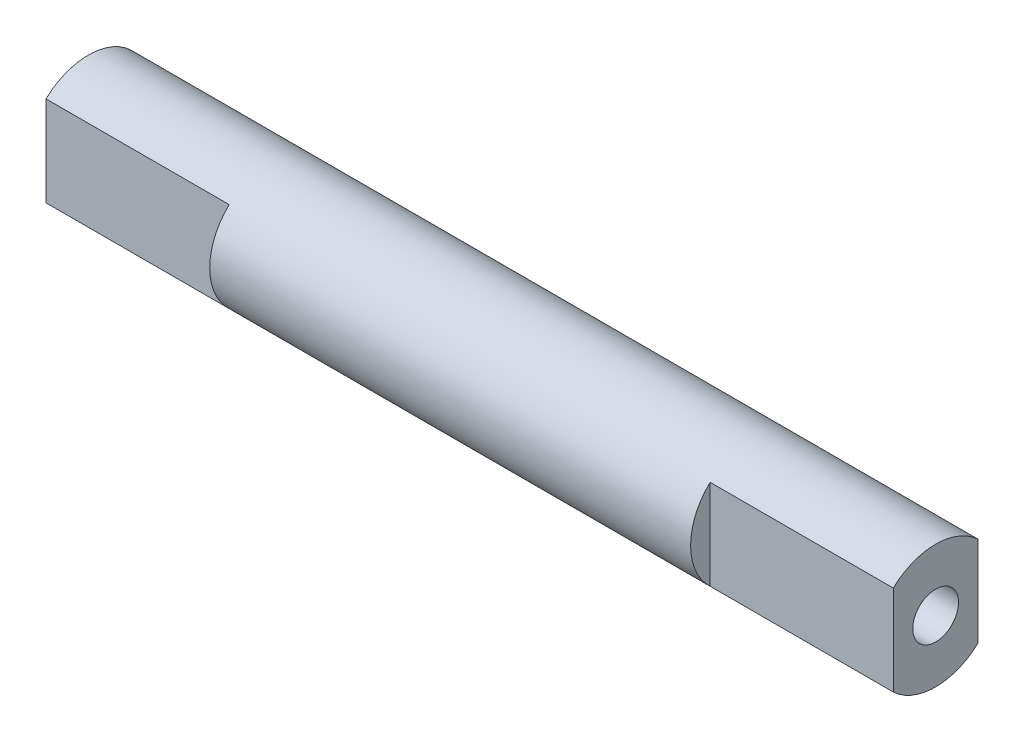
ISO-10303-21;
HEADER;
FILE_DESCRIPTION(('STEP AP214'),'2;1');
FILE_NAME('part.step','',(''),(''),'','','');
FILE_SCHEMA(('AUTOMOTIVE_DESIGN { 1 0 10303 214 1 1 1 1 }'));
ENDSEC;
DATA;
#1=APPLICATION_CONTEXT('core data for automotive mechanical design processes');
#2=APPLICATION_PROTOCOL_DEFINITION('international standard','automotive_design',2000,#1);
#3=PRODUCT_CONTEXT('',#1,'mechanical');
#4=PRODUCT('Part','Part','',(#3));
#5=PRODUCT_RELATED_PRODUCT_CATEGORY('part','',(#4));
#6=PRODUCT_DEFINITION_FORMATION('','',#4);
#7=PRODUCT_DEFINITION_CONTEXT('part definition',#1,'design');
#8=PRODUCT_DEFINITION('design','',#6,#7);
#9=PRODUCT_DEFINITION_SHAPE('','',#8);
#10=(LENGTH_UNIT() NAMED_UNIT(*) SI_UNIT(.MILLI.,.METRE.));
#11=(NAMED_UNIT(*) PLANE_ANGLE_UNIT() SI_UNIT($,.RADIAN.));
#12=(NAMED_UNIT(*) SI_UNIT($,.STERADIAN.) SOLID_ANGLE_UNIT());
#13=UNCERTAINTY_MEASURE_WITH_UNIT(LENGTH_MEASURE(1.E-05),#10,'distance_accuracy_value','');
#14=(GEOMETRIC_REPRESENTATION_CONTEXT(3) GLOBAL_UNCERTAINTY_ASSIGNED_CONTEXT((#13)) GLOBAL_UNIT_ASSIGNED_CONTEXT((#10,
#11,#12)) REPRESENTATION_CONTEXT('',''));
#15=CARTESIAN_POINT('',(0.,0.,0.));
#16=DIRECTION('',(0.,0.,1.));
#17=DIRECTION('',(1.,0.,0.));
#18=AXIS2_PLACEMENT_3D('',#15,#16,#17);
#19=CARTESIAN_POINT('',(18.5,0.,0.));
#20=DIRECTION('',(-1.,0.,0.));
#21=DIRECTION('',(0.,0.,1.));
#22=AXIS2_PLACEMENT_3D('',#19,#20,#21);
#23=CYLINDRICAL_SURFACE('',#22,2.7);
#24=CARTESIAN_POINT('',(18.5,0.,0.));
#25=DIRECTION('',(1.,0.,0.));
#26=DIRECTION('',(0.,0.,-1.));
#27=AXIS2_PLACEMENT_3D('',#24,#25,#26);
#28=CIRCLE('',#27,2.7);
#29=CARTESIAN_POINT('',(18.5,-1.96659604392971,1.85));
#30=VERTEX_POINT('',#29);
#31=CARTESIAN_POINT('',(18.5,-1.96659604392971,-1.85));
#32=VERTEX_POINT('',#31);
#33=EDGE_CURVE('E42',#30,#32,#28,.T.);
#34=ORIENTED_EDGE('',*,*,#33,.F.);
#35=DIRECTION('',(1.,0.,0.));
#36=VECTOR('',#35,1.);
#37=CARTESIAN_POINT('',(10.5,-1.96659604392971,1.85));
#38=LINE('',#37,#36);
#39=CARTESIAN_POINT('',(10.5,-1.96659604392971,1.85));
#40=VERTEX_POINT('',#39);
#41=EDGE_CURVE('E141',#40,#30,#38,.T.);
#42=ORIENTED_EDGE('',*,*,#41,.F.);
#43=CARTESIAN_POINT('',(10.5,0.,0.));
#44=DIRECTION('',(1.,0.,0.));
#45=DIRECTION('',(0.,0.,-1.));
#46=AXIS2_PLACEMENT_3D('',#43,#44,#45);
#47=CIRCLE('',#46,2.7);
#48=CARTESIAN_POINT('',(10.5,1.96659604392971,1.85));
#49=VERTEX_POINT('',#48);
#50=EDGE_CURVE('E135',#49,#40,#47,.T.);
#51=ORIENTED_EDGE('',*,*,#50,.F.);
#52=DIRECTION('',(1.,0.,0.));
#53=VECTOR('',#52,1.);
#54=CARTESIAN_POINT('',(10.5,1.96659604392971,1.85));
#55=LINE('',#54,#53);
#56=CARTESIAN_POINT('',(18.5,1.96659604392971,1.85));
#57=VERTEX_POINT('',#56);
#58=EDGE_CURVE('E144',#49,#57,#55,.T.);
#59=ORIENTED_EDGE('',*,*,#58,.T.);
#60=CARTESIAN_POINT('',(18.5,1.96659604392971,-1.85));
#61=VERTEX_POINT('',#60);
#62=EDGE_CURVE('E11',#61,#57,#28,.T.);
#63=ORIENTED_EDGE('',*,*,#62,.F.);
#64=DIRECTION('',(1.,0.,0.));
#65=VECTOR('',#64,1.);
#66=CARTESIAN_POINT('',(10.5,1.96659604392971,-1.85));
#67=LINE('',#66,#65);
#68=CARTESIAN_POINT('',(10.5,1.96659604392971,-1.85));
#69=VERTEX_POINT('',#68);
#70=EDGE_CURVE('E154',#69,#61,#67,.T.);
#71=ORIENTED_EDGE('',*,*,#70,.F.);
#72=CARTESIAN_POINT('',(10.5,0.,0.));
#73=DIRECTION('',(1.,0.,0.));
#74=DIRECTION('',(0.,0.,-1.));
#75=AXIS2_PLACEMENT_3D('',#72,#73,#74);
#76=CIRCLE('',#75,2.7);
#77=CARTESIAN_POINT('',(10.5,-1.96659604392971,-1.85));
#78=VERTEX_POINT('',#77);
#79=EDGE_CURVE('E149',#78,#69,#76,.T.);
#80=ORIENTED_EDGE('',*,*,#79,.F.);
#81=DIRECTION('',(1.,0.,0.));
#82=VECTOR('',#81,1.);
#83=CARTESIAN_POINT('',(10.5,-1.96659604392971,-1.85));
#84=LINE('',#83,#82);
#85=EDGE_CURVE('E143',#78,#32,#84,.T.);
#86=ORIENTED_EDGE('',*,*,#85,.T.);
#87=EDGE_LOOP('',(#34,#42,#51,#59,#63,#71,#80,#86));
#88=FACE_BOUND('',#87,.T.);
#89=DIRECTION('',(-1.,0.,0.));
#90=VECTOR('',#89,1.);
#91=CARTESIAN_POINT('',(-10.5,1.96659604392971,1.85));
#92=LINE('',#91,#90);
#93=CARTESIAN_POINT('',(-10.5,1.96659604392971,1.85));
#94=VERTEX_POINT('',#93);
#95=CARTESIAN_POINT('',(-18.5,1.96659604392971,1.85));
#96=VERTEX_POINT('',#95);
#97=EDGE_CURVE('E57',#94,#96,#92,.T.);
#98=ORIENTED_EDGE('',*,*,#97,.F.);
#99=CARTESIAN_POINT('',(-10.5,0.,0.));
#100=DIRECTION('',(1.,0.,0.));
#101=DIRECTION('',(0.,0.,-1.));
#102=AXIS2_PLACEMENT_3D('',#99,#100,#101);
#103=CIRCLE('',#102,2.7);
#104=CARTESIAN_POINT('',(-10.5,-1.96659604392971,1.85));
#105=VERTEX_POINT('',#104);
#106=EDGE_CURVE('E104',#94,#105,#103,.T.);
#107=ORIENTED_EDGE('',*,*,#106,.T.);
#108=DIRECTION('',(-1.,0.,0.));
#109=VECTOR('',#108,1.);
#110=CARTESIAN_POINT('',(-10.5,-1.96659604392971,1.85));
#111=LINE('',#110,#109);
#112=CARTESIAN_POINT('',(-18.5,-1.96659604392971,1.85));
#113=VERTEX_POINT('',#112);
#114=EDGE_CURVE('E101',#105,#113,#111,.T.);
#115=ORIENTED_EDGE('',*,*,#114,.T.);
#116=CARTESIAN_POINT('',(-18.5,0.,0.));
#117=DIRECTION('',(1.,0.,0.));
#118=DIRECTION('',(0.,0.,-1.));
#119=AXIS2_PLACEMENT_3D('',#116,#117,#118);
#120=CIRCLE('',#119,2.7);
#121=CARTESIAN_POINT('',(-18.5,-1.96659604392971,-1.85));
#122=VERTEX_POINT('',#121);
#123=EDGE_CURVE('E147',#113,#122,#120,.T.);
#124=ORIENTED_EDGE('',*,*,#123,.T.);
#125=DIRECTION('',(-1.,0.,0.));
#126=VECTOR('',#125,1.);
#127=CARTESIAN_POINT('',(-10.5,-1.96659604392971,-1.85));
#128=LINE('',#127,#126);
#129=CARTESIAN_POINT('',(-10.5,-1.96659604392971,-1.85));
#130=VERTEX_POINT('',#129);
#131=EDGE_CURVE('E49',#130,#122,#128,.T.);
#132=ORIENTED_EDGE('',*,*,#131,.F.);
#133=CARTESIAN_POINT('',(-10.5,0.,0.));
#134=DIRECTION('',(1.,0.,0.));
#135=DIRECTION('',(0.,0.,-1.));
#136=AXIS2_PLACEMENT_3D('',#133,#134,#135);
#137=CIRCLE('',#136,2.7);
#138=CARTESIAN_POINT('',(-10.5,1.96659604392971,-1.85));
#139=VERTEX_POINT('',#138);
#140=EDGE_CURVE('E118',#130,#139,#137,.T.);
#141=ORIENTED_EDGE('',*,*,#140,.T.);
#142=DIRECTION('',(-1.,0.,0.));
#143=VECTOR('',#142,1.);
#144=CARTESIAN_POINT('',(-10.5,1.96659604392971,-1.85));
#145=LINE('',#144,#143);
#146=CARTESIAN_POINT('',(-18.5,1.96659604392971,-1.85));
#147=VERTEX_POINT('',#146);
#148=EDGE_CURVE('E126',#139,#147,#145,.T.);
#149=ORIENTED_EDGE('',*,*,#148,.T.);
#150=EDGE_CURVE('E37',#147,#96,#120,.T.);
#151=ORIENTED_EDGE('',*,*,#150,.T.);
#152=EDGE_LOOP('',(#98,#107,#115,#124,#132,#141,#149,#151));
#153=FACE_BOUND('',#152,.T.);
#154=ADVANCED_FACE('F34',(#88,#153),#23,.T.);
#155=CARTESIAN_POINT('',(-18.5,0.,0.));
#156=DIRECTION('',(1.,0.,0.));
#157=DIRECTION('',(0.,0.,-1.));
#158=AXIS2_PLACEMENT_3D('',#155,#156,#157);
#159=PLANE('',#158);
#160=CARTESIAN_POINT('',(-18.5,0.,0.));
#161=DIRECTION('',(1.,0.,0.));
#162=DIRECTION('',(0.,0.,-1.));
#163=AXIS2_PLACEMENT_3D('',#160,#161,#162);
#164=CIRCLE('',#163,1.);
#165=CARTESIAN_POINT('',(-18.5,0.,-1.));
#166=VERTEX_POINT('',#165);
#167=EDGE_CURVE('E286',#166,#166,#164,.T.);
#168=ORIENTED_EDGE('',*,*,#167,.T.);
#169=EDGE_LOOP('',(#168));
#170=FACE_BOUND('',#169,.T.);
#171=DIRECTION('',(0.,1.,0.));
#172=VECTOR('',#171,1.);
#173=CARTESIAN_POINT('',(-18.5,1.96659604392971,1.85));
#174=LINE('',#173,#172);
#175=EDGE_CURVE('E108',#113,#96,#174,.T.);
#176=ORIENTED_EDGE('',*,*,#175,.T.);
#177=ORIENTED_EDGE('',*,*,#150,.F.);
#178=DIRECTION('',(0.,-1.,0.));
#179=VECTOR('',#178,1.);
#180=CARTESIAN_POINT('',(-18.5,1.96659604392971,-1.85));
#181=LINE('',#180,#179);
#182=EDGE_CURVE('E122',#147,#122,#181,.T.);
#183=ORIENTED_EDGE('',*,*,#182,.T.);
#184=ORIENTED_EDGE('',*,*,#123,.F.);
#185=EDGE_LOOP('',(#176,#177,#183,#184));
#186=FACE_BOUND('',#185,.T.);
#187=ADVANCED_FACE('F191',(#170,#186),#159,.F.);
#188=CARTESIAN_POINT('',(18.5,0.,0.));
#189=DIRECTION('',(1.,0.,0.));
#190=DIRECTION('',(0.,0.,-1.));
#191=AXIS2_PLACEMENT_3D('',#188,#189,#190);
#192=PLANE('',#191);
#193=CARTESIAN_POINT('',(18.5,0.,0.));
#194=DIRECTION('',(1.,0.,0.));
#195=DIRECTION('',(0.,0.,-1.));
#196=AXIS2_PLACEMENT_3D('',#193,#194,#195);
#197=CIRCLE('',#196,1.);
#198=CARTESIAN_POINT('',(18.5,0.,-1.));
#199=VERTEX_POINT('',#198);
#200=EDGE_CURVE('E114',#199,#199,#197,.T.);
#201=ORIENTED_EDGE('',*,*,#200,.F.);
#202=EDGE_LOOP('',(#201));
#203=FACE_BOUND('',#202,.T.);
#204=DIRECTION('',(0.,1.,0.));
#205=VECTOR('',#204,1.);
#206=CARTESIAN_POINT('',(18.5,1.96659604392971,1.85));
#207=LINE('',#206,#205);
#208=EDGE_CURVE('E138',#30,#57,#207,.T.);
#209=ORIENTED_EDGE('',*,*,#208,.F.);
#210=ORIENTED_EDGE('',*,*,#33,.T.);
#211=DIRECTION('',(0.,-1.,0.));
#212=VECTOR('',#211,1.);
#213=CARTESIAN_POINT('',(18.5,1.96659604392971,-1.85));
#214=LINE('',#213,#212);
#215=EDGE_CURVE('E132',#61,#32,#214,.T.);
#216=ORIENTED_EDGE('',*,*,#215,.F.);
#217=ORIENTED_EDGE('',*,*,#62,.T.);
#218=EDGE_LOOP('',(#209,#210,#216,#217));
#219=FACE_BOUND('',#218,.T.);
#220=ADVANCED_FACE('F169',(#203,#219),#192,.T.);
#221=CARTESIAN_POINT('',(10.5,1.96659604392971,-1.85));
#222=DIRECTION('',(0.,0.,1.));
#223=DIRECTION('',(1.,0.,0.));
#224=AXIS2_PLACEMENT_3D('',#221,#222,#223);
#225=PLANE('',#224);
#226=ORIENTED_EDGE('',*,*,#215,.T.);
#227=ORIENTED_EDGE('',*,*,#85,.F.);
#228=DIRECTION('',(0.,-1.,0.));
#229=VECTOR('',#228,1.);
#230=CARTESIAN_POINT('',(10.5,1.96659604392971,-1.85));
#231=LINE('',#230,#229);
#232=EDGE_CURVE('E151',#69,#78,#231,.T.);
#233=ORIENTED_EDGE('',*,*,#232,.F.);
#234=ORIENTED_EDGE('',*,*,#70,.T.);
#235=EDGE_LOOP('',(#226,#227,#233,#234));
#236=FACE_BOUND('',#235,.T.);
#237=ADVANCED_FACE('F162',(#236),#225,.F.);
#238=CARTESIAN_POINT('',(10.5,0.,0.));
#239=DIRECTION('',(1.,0.,0.));
#240=DIRECTION('',(0.,0.,-1.));
#241=AXIS2_PLACEMENT_3D('',#238,#239,#240);
#242=PLANE('',#241);
#243=ORIENTED_EDGE('',*,*,#79,.T.);
#244=ORIENTED_EDGE('',*,*,#232,.T.);
#245=EDGE_LOOP('',(#243,#244));
#246=FACE_BOUND('',#245,.T.);
#247=ADVANCED_FACE('F188',(#246),#242,.T.);
#248=CARTESIAN_POINT('',(10.5,1.96659604392971,1.85));
#249=DIRECTION('',(0.,0.,-1.));
#250=DIRECTION('',(-1.,0.,0.));
#251=AXIS2_PLACEMENT_3D('',#248,#249,#250);
#252=PLANE('',#251);
#253=ORIENTED_EDGE('',*,*,#208,.T.);
#254=ORIENTED_EDGE('',*,*,#58,.F.);
#255=DIRECTION('',(0.,1.,0.));
#256=VECTOR('',#255,1.);
#257=CARTESIAN_POINT('',(10.5,1.96659604392971,1.85));
#258=LINE('',#257,#256);
#259=EDGE_CURVE('E137',#40,#49,#258,.T.);
#260=ORIENTED_EDGE('',*,*,#259,.F.);
#261=ORIENTED_EDGE('',*,*,#41,.T.);
#262=EDGE_LOOP('',(#253,#254,#260,#261));
#263=FACE_BOUND('',#262,.T.);
#264=ADVANCED_FACE('F175',(#263),#252,.F.);
#265=CARTESIAN_POINT('',(10.5,0.,0.));
#266=DIRECTION('',(1.,0.,0.));
#267=DIRECTION('',(0.,0.,-1.));
#268=AXIS2_PLACEMENT_3D('',#265,#266,#267);
#269=PLANE('',#268);
#270=ORIENTED_EDGE('',*,*,#50,.T.);
#271=ORIENTED_EDGE('',*,*,#259,.T.);
#272=EDGE_LOOP('',(#270,#271));
#273=FACE_BOUND('',#272,.T.);
#274=ADVANCED_FACE('F177',(#273),#269,.T.);
#275=CARTESIAN_POINT('',(12.5,0.,0.));
#276=DIRECTION('',(1.,0.,0.));
#277=DIRECTION('',(0.,0.,-1.));
#278=AXIS2_PLACEMENT_3D('',#275,#276,#277);
#279=CYLINDRICAL_SURFACE('',#278,1.);
#280=CARTESIAN_POINT('',(12.5,0.,0.));
#281=DIRECTION('',(1.,0.,0.));
#282=DIRECTION('',(0.,0.,-1.));
#283=AXIS2_PLACEMENT_3D('',#280,#281,#282);
#284=CIRCLE('',#283,1.);
#285=CARTESIAN_POINT('',(12.5,0.,-1.));
#286=VERTEX_POINT('',#285);
#287=EDGE_CURVE('E129',#286,#286,#284,.T.);
#288=ORIENTED_EDGE('',*,*,#287,.F.);
#289=EDGE_LOOP('',(#288));
#290=FACE_BOUND('',#289,.T.);
#291=ORIENTED_EDGE('',*,*,#200,.T.);
#292=EDGE_LOOP('',(#291));
#293=FACE_BOUND('',#292,.T.);
#294=ADVANCED_FACE('F179',(#290,#293),#279,.F.);
#295=CARTESIAN_POINT('',(12.5,0.,0.));
#296=DIRECTION('',(1.,0.,0.));
#297=DIRECTION('',(0.,0.,-1.));
#298=AXIS2_PLACEMENT_3D('',#295,#296,#297);
#299=PLANE('',#298);
#300=ORIENTED_EDGE('',*,*,#287,.T.);
#301=EDGE_LOOP('',(#300));
#302=FACE_BOUND('',#301,.T.);
#303=ADVANCED_FACE('F185',(#302),#299,.T.);
#304=CARTESIAN_POINT('',(-10.5,1.96659604392971,-1.85));
#305=DIRECTION('',(0.,0.,-1.));
#306=DIRECTION('',(-1.,0.,0.));
#307=AXIS2_PLACEMENT_3D('',#304,#305,#306);
#308=PLANE('',#307);
#309=ORIENTED_EDGE('',*,*,#182,.F.);
#310=ORIENTED_EDGE('',*,*,#148,.F.);
#311=DIRECTION('',(0.,-1.,0.));
#312=VECTOR('',#311,1.);
#313=CARTESIAN_POINT('',(-10.5,1.96659604392971,-1.85));
#314=LINE('',#313,#312);
#315=EDGE_CURVE('E121',#139,#130,#314,.T.);
#316=ORIENTED_EDGE('',*,*,#315,.T.);
#317=ORIENTED_EDGE('',*,*,#131,.T.);
#318=EDGE_LOOP('',(#309,#310,#316,#317));
#319=FACE_BOUND('',#318,.T.);
#320=ADVANCED_FACE('F213',(#319),#308,.T.);
#321=CARTESIAN_POINT('',(-10.5,0.,0.));
#322=DIRECTION('',(-1.,0.,0.));
#323=DIRECTION('',(0.,0.,-1.));
#324=AXIS2_PLACEMENT_3D('',#321,#322,#323);
#325=PLANE('',#324);
#326=ORIENTED_EDGE('',*,*,#140,.F.);
#327=ORIENTED_EDGE('',*,*,#315,.F.);
#328=EDGE_LOOP('',(#326,#327));
#329=FACE_BOUND('',#328,.T.);
#330=ADVANCED_FACE('F216',(#329),#325,.T.);
#331=CARTESIAN_POINT('',(-10.5,1.96659604392971,1.85));
#332=DIRECTION('',(0.,0.,1.));
#333=DIRECTION('',(1.,0.,0.));
#334=AXIS2_PLACEMENT_3D('',#331,#332,#333);
#335=PLANE('',#334);
#336=ORIENTED_EDGE('',*,*,#175,.F.);
#337=ORIENTED_EDGE('',*,*,#114,.F.);
#338=DIRECTION('',(0.,1.,0.));
#339=VECTOR('',#338,1.);
#340=CARTESIAN_POINT('',(-10.5,1.96659604392971,1.85));
#341=LINE('',#340,#339);
#342=EDGE_CURVE('E97',#105,#94,#341,.T.);
#343=ORIENTED_EDGE('',*,*,#342,.T.);
#344=ORIENTED_EDGE('',*,*,#97,.T.);
#345=EDGE_LOOP('',(#336,#337,#343,#344));
#346=FACE_BOUND('',#345,.T.);
#347=ADVANCED_FACE('F99',(#346),#335,.T.);
#348=CARTESIAN_POINT('',(-10.5,0.,0.));
#349=DIRECTION('',(-1.,0.,0.));
#350=DIRECTION('',(0.,0.,-1.));
#351=AXIS2_PLACEMENT_3D('',#348,#349,#350);
#352=PLANE('',#351);
#353=ORIENTED_EDGE('',*,*,#106,.F.);
#354=ORIENTED_EDGE('',*,*,#342,.F.);
#355=EDGE_LOOP('',(#353,#354));
#356=FACE_BOUND('',#355,.T.);
#357=ADVANCED_FACE('F106',(#356),#352,.T.);
#358=CARTESIAN_POINT('',(-12.5,0.,0.));
#359=DIRECTION('',(-1.,0.,0.));
#360=DIRECTION('',(0.,0.,1.));
#361=AXIS2_PLACEMENT_3D('',#358,#359,#360);
#362=CYLINDRICAL_SURFACE('',#361,1.);
#363=CARTESIAN_POINT('',(-12.5,0.,0.));
#364=DIRECTION('',(1.,0.,0.));
#365=DIRECTION('',(0.,0.,-1.));
#366=AXIS2_PLACEMENT_3D('',#363,#364,#365);
#367=CIRCLE('',#366,1.);
#368=CARTESIAN_POINT('',(-12.5,0.,-1.));
#369=VERTEX_POINT('',#368);
#370=EDGE_CURVE('E125',#369,#369,#367,.T.);
#371=ORIENTED_EDGE('',*,*,#370,.T.);
#372=EDGE_LOOP('',(#371));
#373=FACE_BOUND('',#372,.T.);
#374=ORIENTED_EDGE('',*,*,#167,.F.);
#375=EDGE_LOOP('',(#374));
#376=FACE_BOUND('',#375,.T.);
#377=ADVANCED_FACE('F262',(#373,#376),#362,.F.);
#378=CARTESIAN_POINT('',(-12.5,0.,0.));
#379=DIRECTION('',(-1.,0.,0.));
#380=DIRECTION('',(0.,0.,-1.));
#381=AXIS2_PLACEMENT_3D('',#378,#379,#380);
#382=PLANE('',#381);
#383=ORIENTED_EDGE('',*,*,#370,.F.);
#384=EDGE_LOOP('',(#383));
#385=FACE_BOUND('',#384,.T.);
#386=ADVANCED_FACE('F270',(#385),#382,.T.);
#387=CLOSED_SHELL('',(#154,#187,#220,#237,#247,#264,#274,#294,#303,#320,#330,#347,#357,#377,#386));
#388=MANIFOLD_SOLID_BREP('B2',#387);
#389=ADVANCED_BREP_SHAPE_REPRESENTATION('',(#18,#388),#14);
#390=SHAPE_DEFINITION_REPRESENTATION(#9,#389);
ENDSEC;
END-ISO-10303-21;
